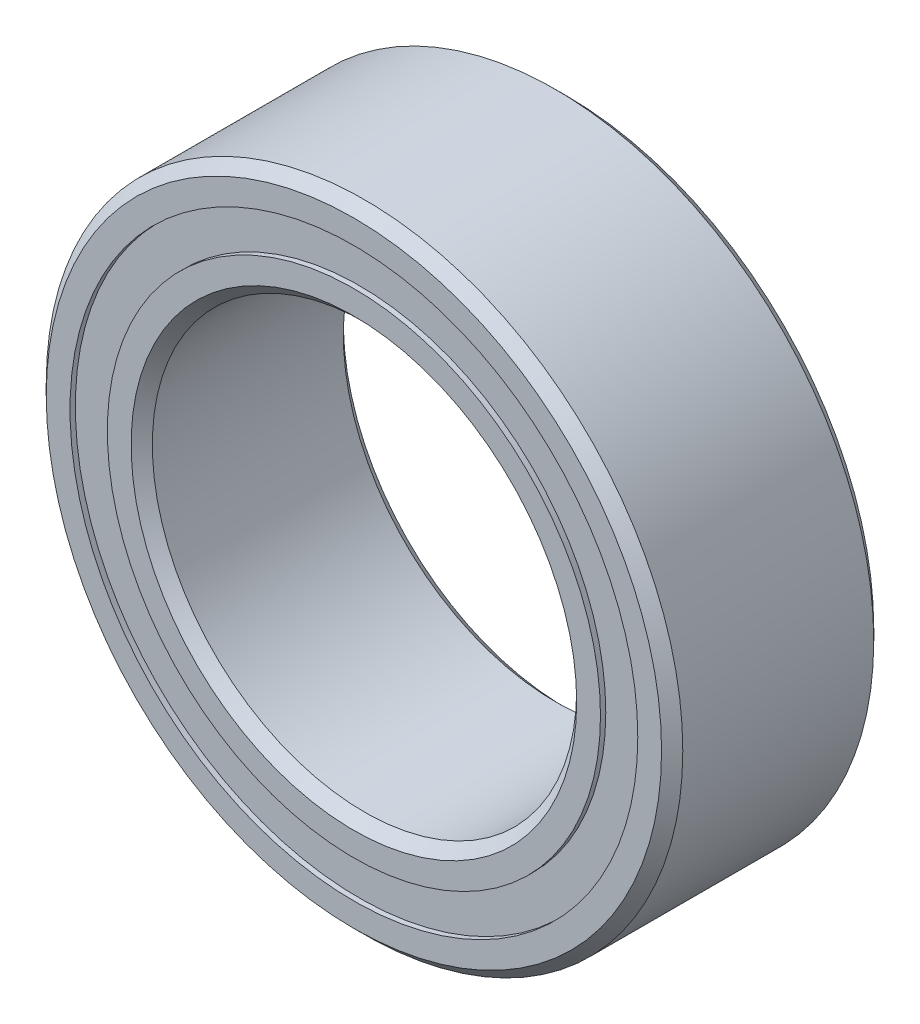
ISO-10303-21;
HEADER;
FILE_DESCRIPTION(('STEP AP214'),'2;1');
FILE_NAME('part.step','',(''),(''),'','','');
FILE_SCHEMA(('AUTOMOTIVE_DESIGN { 1 0 10303 214 1 1 1 1 }'));
ENDSEC;
DATA;
#1=APPLICATION_CONTEXT('core data for automotive mechanical design processes');
#2=APPLICATION_PROTOCOL_DEFINITION('international standard','automotive_design',2000,#1);
#3=PRODUCT_CONTEXT('',#1,'mechanical');
#4=PRODUCT('Part','Part','',(#3));
#5=PRODUCT_RELATED_PRODUCT_CATEGORY('part','',(#4));
#6=PRODUCT_DEFINITION_FORMATION('','',#4);
#7=PRODUCT_DEFINITION_CONTEXT('part definition',#1,'design');
#8=PRODUCT_DEFINITION('design','',#6,#7);
#9=PRODUCT_DEFINITION_SHAPE('','',#8);
#10=(LENGTH_UNIT() NAMED_UNIT(*) SI_UNIT(.MILLI.,.METRE.));
#11=(NAMED_UNIT(*) PLANE_ANGLE_UNIT() SI_UNIT($,.RADIAN.));
#12=(NAMED_UNIT(*) SI_UNIT($,.STERADIAN.) SOLID_ANGLE_UNIT());
#13=UNCERTAINTY_MEASURE_WITH_UNIT(LENGTH_MEASURE(1.E-05),#10,'distance_accuracy_value','');
#14=(GEOMETRIC_REPRESENTATION_CONTEXT(3) GLOBAL_UNCERTAINTY_ASSIGNED_CONTEXT((#13)) GLOBAL_UNIT_ASSIGNED_CONTEXT((#10,
#11,#12)) REPRESENTATION_CONTEXT('',''));
#15=CARTESIAN_POINT('',(0.,0.,0.));
#16=DIRECTION('',(0.,0.,1.));
#17=DIRECTION('',(1.,0.,0.));
#18=AXIS2_PLACEMENT_3D('',#15,#16,#17);
#19=CARTESIAN_POINT('',(-3.96875,0.,0.));
#20=DIRECTION('',(-1.,0.,0.));
#21=DIRECTION('',(0.,0.,-1.));
#22=AXIS2_PLACEMENT_3D('',#19,#20,#21);
#23=SPHERICAL_SURFACE('',#22,0.758760243513404);
#24=CARTESIAN_POINT('',(-4.7275102435134,0.,0.));
#25=VERTEX_POINT('',#24);
#26=VERTEX_LOOP('',#25);
#27=FACE_BOUND('',#26,.T.);
#28=CARTESIAN_POINT('',(-3.2099897564866,0.,0.));
#29=VERTEX_POINT('',#28);
#30=VERTEX_LOOP('',#29);
#31=FACE_BOUND('',#30,.T.);
#32=ADVANCED_FACE('P0_F16',(#27,#31),#23,.T.);
#33=CLOSED_SHELL('',(#32));
#34=MANIFOLD_SOLID_BREP('P0_B1',#33);
#35=CARTESIAN_POINT('',(0.,3.96875,0.));
#36=DIRECTION('',(0.,1.,0.));
#37=DIRECTION('',(0.,0.,-1.));
#38=AXIS2_PLACEMENT_3D('',#35,#36,#37);
#39=SPHERICAL_SURFACE('',#38,0.758760243513404);
#40=CARTESIAN_POINT('',(0.,3.2099897564866,0.));
#41=VERTEX_POINT('',#40);
#42=VERTEX_LOOP('',#41);
#43=FACE_BOUND('',#42,.T.);
#44=CARTESIAN_POINT('',(0.,4.7275102435134,0.));
#45=VERTEX_POINT('',#44);
#46=VERTEX_LOOP('',#45);
#47=FACE_BOUND('',#46,.T.);
#48=ADVANCED_FACE('P1_F16',(#43,#47),#39,.T.);
#49=CLOSED_SHELL('',(#48));
#50=MANIFOLD_SOLID_BREP('P1_B1',#49);
#51=CARTESIAN_POINT('',(3.96875,0.,0.));
#52=DIRECTION('',(1.,0.,0.));
#53=DIRECTION('',(0.,0.,-1.));
#54=AXIS2_PLACEMENT_3D('',#51,#52,#53);
#55=SPHERICAL_SURFACE('',#54,0.758760243513404);
#56=CARTESIAN_POINT('',(3.2099897564866,0.,0.));
#57=VERTEX_POINT('',#56);
#58=VERTEX_LOOP('',#57);
#59=FACE_BOUND('',#58,.T.);
#60=CARTESIAN_POINT('',(4.7275102435134,0.,0.));
#61=VERTEX_POINT('',#60);
#62=VERTEX_LOOP('',#61);
#63=FACE_BOUND('',#62,.T.);
#64=ADVANCED_FACE('P2_F16',(#59,#63),#55,.T.);
#65=CLOSED_SHELL('',(#64));
#66=MANIFOLD_SOLID_BREP('P2_B1',#65);
#67=CARTESIAN_POINT('',(1.98437499999998,-3.4370383212695,0.));
#68=DIRECTION('',(0.499999999999995,-0.866025403784442,0.));
#69=DIRECTION('',(0.,0.,-1.));
#70=AXIS2_PLACEMENT_3D('',#67,#68,#69);
#71=SPHERICAL_SURFACE('',#70,0.758760243513404);
#72=CARTESIAN_POINT('',(2.36375512175668,-4.09414396753378,0.));
#73=VERTEX_POINT('',#72);
#74=VERTEX_LOOP('',#73);
#75=FACE_BOUND('',#74,.T.);
#76=CARTESIAN_POINT('',(1.60499487824328,-2.77993267500523,0.));
#77=VERTEX_POINT('',#76);
#78=VERTEX_LOOP('',#77);
#79=FACE_BOUND('',#78,.T.);
#80=ADVANCED_FACE('P3_F16',(#75,#79),#71,.T.);
#81=CLOSED_SHELL('',(#80));
#82=MANIFOLD_SOLID_BREP('P3_B1',#81);
#83=CARTESIAN_POINT('',(3.43703832126948,-1.98437500000002,0.));
#84=DIRECTION('',(0.866025403784437,-0.500000000000004,0.));
#85=DIRECTION('',(0.,0.,-1.));
#86=AXIS2_PLACEMENT_3D('',#83,#84,#85);
#87=SPHERICAL_SURFACE('',#86,0.758760243513404);
#88=CARTESIAN_POINT('',(4.09414396753376,-2.36375512175672,0.));
#89=VERTEX_POINT('',#88);
#90=VERTEX_LOOP('',#89);
#91=FACE_BOUND('',#90,.T.);
#92=CARTESIAN_POINT('',(2.77993267500521,-1.60499487824331,0.));
#93=VERTEX_POINT('',#92);
#94=VERTEX_LOOP('',#93);
#95=FACE_BOUND('',#94,.T.);
#96=ADVANCED_FACE('P4_F16',(#91,#95),#87,.T.);
#97=CLOSED_SHELL('',(#96));
#98=MANIFOLD_SOLID_BREP('P4_B1',#97);
#99=CARTESIAN_POINT('',(1.984375,3.43703832126949,0.));
#100=DIRECTION('',(0.500000000000001,0.866025403784438,0.));
#101=DIRECTION('',(0.,0.,-1.));
#102=AXIS2_PLACEMENT_3D('',#99,#100,#101);
#103=SPHERICAL_SURFACE('',#102,0.758760243513404);
#104=CARTESIAN_POINT('',(2.36375512175671,4.09414396753376,0.));
#105=VERTEX_POINT('',#104);
#106=VERTEX_LOOP('',#105);
#107=FACE_BOUND('',#106,.T.);
#108=CARTESIAN_POINT('',(1.6049948782433,2.77993267500521,0.));
#109=VERTEX_POINT('',#108);
#110=VERTEX_LOOP('',#109);
#111=FACE_BOUND('',#110,.T.);
#112=ADVANCED_FACE('P5_F16',(#107,#111),#103,.T.);
#113=CLOSED_SHELL('',(#112));
#114=MANIFOLD_SOLID_BREP('P5_B1',#113);
#115=CARTESIAN_POINT('',(-3.43703832126947,1.98437500000004,0.));
#116=DIRECTION('',(-0.866025403784433,0.50000000000001,0.));
#117=DIRECTION('',(0.,0.,-1.));
#118=AXIS2_PLACEMENT_3D('',#115,#116,#117);
#119=SPHERICAL_SURFACE('',#118,0.758760243513404);
#120=CARTESIAN_POINT('',(-2.7799326750052,1.60499487824333,0.));
#121=VERTEX_POINT('',#120);
#122=VERTEX_LOOP('',#121);
#123=FACE_BOUND('',#122,.T.);
#124=CARTESIAN_POINT('',(-4.09414396753374,2.36375512175675,0.));
#125=VERTEX_POINT('',#124);
#126=VERTEX_LOOP('',#125);
#127=FACE_BOUND('',#126,.T.);
#128=ADVANCED_FACE('P6_F16',(#123,#127),#119,.T.);
#129=CLOSED_SHELL('',(#128));
#130=MANIFOLD_SOLID_BREP('P6_B1',#129);
#131=CARTESIAN_POINT('',(0.,4.24787087912088,-1.508125));
#132=DIRECTION('',(0.,0.,1.));
#133=DIRECTION('',(1.,0.,0.));
#134=AXIS2_PLACEMENT_3D('',#131,#132,#133);
#135=PLANE('',#134);
#136=CARTESIAN_POINT('',(0.,0.,-1.508125));
#137=DIRECTION('',(0.,0.,1.));
#138=DIRECTION('',(1.,0.,0.));
#139=AXIS2_PLACEMENT_3D('',#136,#137,#138);
#140=CIRCLE('',#139,3.68962912087912);
#141=CARTESIAN_POINT('',(3.68962912087912,0.,-1.508125));
#142=VERTEX_POINT('',#141);
#143=EDGE_CURVE('P7_E18',#142,#142,#140,.T.);
#144=ORIENTED_EDGE('',*,*,#143,.T.);
#145=EDGE_LOOP('',(#144));
#146=FACE_BOUND('',#145,.T.);
#147=CARTESIAN_POINT('',(0.,0.,-1.508125));
#148=DIRECTION('',(0.,0.,1.));
#149=DIRECTION('',(1.,0.,0.));
#150=AXIS2_PLACEMENT_3D('',#147,#148,#149);
#151=CIRCLE('',#150,4.24787087912088);
#152=CARTESIAN_POINT('',(4.24787087912088,0.,-1.508125));
#153=VERTEX_POINT('',#152);
#154=EDGE_CURVE('P7_E27',#153,#153,#151,.T.);
#155=ORIENTED_EDGE('',*,*,#154,.F.);
#156=EDGE_LOOP('',(#155));
#157=FACE_BOUND('',#156,.T.);
#158=ADVANCED_FACE('P7_F15',(#146,#157),#135,.F.);
#159=CARTESIAN_POINT('',(0.,0.,1.5875));
#160=DIRECTION('',(0.,0.,1.));
#161=DIRECTION('',(1.,0.,0.));
#162=AXIS2_PLACEMENT_3D('',#159,#160,#161);
#163=CYLINDRICAL_SURFACE('',#162,3.68962912087912);
#164=ORIENTED_EDGE('',*,*,#143,.F.);
#165=EDGE_LOOP('',(#164));
#166=FACE_BOUND('',#165,.T.);
#167=CARTESIAN_POINT('',(0.,0.,-0.758760243513405));
#168=DIRECTION('',(0.,0.,1.));
#169=DIRECTION('',(1.,0.,0.));
#170=AXIS2_PLACEMENT_3D('',#167,#168,#169);
#171=CIRCLE('',#170,3.68962912087912);
#172=CARTESIAN_POINT('',(3.68962912087912,0.,-0.758760243513405));
#173=VERTEX_POINT('',#172);
#174=EDGE_CURVE('P7_E22',#173,#173,#171,.T.);
#175=ORIENTED_EDGE('',*,*,#174,.T.);
#176=EDGE_LOOP('',(#175));
#177=FACE_BOUND('',#176,.T.);
#178=ADVANCED_FACE('P7_F37',(#166,#177),#163,.F.);
#179=CARTESIAN_POINT('',(0.,0.,1.5875));
#180=DIRECTION('',(0.,0.,1.));
#181=DIRECTION('',(1.,0.,0.));
#182=AXIS2_PLACEMENT_3D('',#179,#180,#181);
#183=CYLINDRICAL_SURFACE('',#182,4.24787087912088);
#184=CARTESIAN_POINT('',(0.,0.,-0.758760243513404));
#185=DIRECTION('',(0.,0.,1.));
#186=DIRECTION('',(1.,0.,0.));
#187=AXIS2_PLACEMENT_3D('',#184,#185,#186);
#188=CIRCLE('',#187,4.24787087912088);
#189=CARTESIAN_POINT('',(4.24787087912088,0.,-0.758760243513404));
#190=VERTEX_POINT('',#189);
#191=EDGE_CURVE('P7_E10',#190,#190,#188,.F.);
#192=ORIENTED_EDGE('',*,*,#191,.T.);
#193=EDGE_LOOP('',(#192));
#194=FACE_BOUND('',#193,.T.);
#195=ORIENTED_EDGE('',*,*,#154,.T.);
#196=EDGE_LOOP('',(#195));
#197=FACE_BOUND('',#196,.T.);
#198=ADVANCED_FACE('P7_F40',(#194,#197),#183,.T.);
#199=CARTESIAN_POINT('',(0.,4.24787087912088,-0.758760243513404));
#200=DIRECTION('',(0.,0.,-1.));
#201=DIRECTION('',(-1.,0.,0.));
#202=AXIS2_PLACEMENT_3D('',#199,#200,#201);
#203=PLANE('',#202);
#204=ORIENTED_EDGE('',*,*,#191,.F.);
#205=EDGE_LOOP('',(#204));
#206=FACE_BOUND('',#205,.T.);
#207=ORIENTED_EDGE('',*,*,#174,.F.);
#208=EDGE_LOOP('',(#207));
#209=FACE_BOUND('',#208,.T.);
#210=ADVANCED_FACE('P7_F43',(#206,#209),#203,.F.);
#211=CLOSED_SHELL('',(#158,#178,#198,#210));
#212=MANIFOLD_SOLID_BREP('P7_B1',#211);
#213=CARTESIAN_POINT('',(0.,0.,0.));
#214=DIRECTION('',(0.,0.,1.));
#215=DIRECTION('',(1.,0.,0.));
#216=AXIS2_PLACEMENT_3D('',#213,#214,#215);
#217=TOROIDAL_SURFACE('',#216,3.96875,0.758760243513403);
#218=CARTESIAN_POINT('',(0.,0.,0.705555555555556));
#219=DIRECTION('',(0.,0.,1.));
#220=DIRECTION('',(1.,0.,0.));
#221=AXIS2_PLACEMENT_3D('',#218,#219,#220);
#222=CIRCLE('',#221,3.68962912087912);
#223=CARTESIAN_POINT('',(3.68962912087912,0.,0.705555555555556));
#224=VERTEX_POINT('',#223);
#225=EDGE_CURVE('P8_E33',#224,#224,#222,.T.);
#226=ORIENTED_EDGE('',*,*,#225,.F.);
#227=EDGE_LOOP('',(#226));
#228=FACE_BOUND('',#227,.T.);
#229=CARTESIAN_POINT('',(0.,0.,-0.705555555555556));
#230=DIRECTION('',(0.,0.,1.));
#231=DIRECTION('',(1.,0.,0.));
#232=AXIS2_PLACEMENT_3D('',#229,#230,#231);
#233=CIRCLE('',#232,3.68962912087912);
#234=CARTESIAN_POINT('',(3.68962912087912,0.,-0.705555555555556));
#235=VERTEX_POINT('',#234);
#236=EDGE_CURVE('P8_E31',#235,#235,#233,.F.);
#237=ORIENTED_EDGE('',*,*,#236,.F.);
#238=EDGE_LOOP('',(#237));
#239=FACE_BOUND('',#238,.T.);
#240=ADVANCED_FACE('P8_F15',(#228,#239),#217,.F.);
#241=CARTESIAN_POINT('',(0.,0.,1.5875));
#242=DIRECTION('',(0.,0.,1.));
#243=DIRECTION('',(1.,0.,0.));
#244=AXIS2_PLACEMENT_3D('',#241,#242,#243);
#245=CYLINDRICAL_SURFACE('',#244,3.68962912087912);
#246=CARTESIAN_POINT('',(0.,0.,1.5875));
#247=DIRECTION('',(0.,0.,1.));
#248=DIRECTION('',(1.,0.,0.));
#249=AXIS2_PLACEMENT_3D('',#246,#247,#248);
#250=CIRCLE('',#249,3.68962912087912);
#251=CARTESIAN_POINT('',(3.68962912087912,0.,1.5875));
#252=VERTEX_POINT('',#251);
#253=EDGE_CURVE('P8_E19',#252,#252,#250,.F.);
#254=ORIENTED_EDGE('',*,*,#253,.T.);
#255=EDGE_LOOP('',(#254));
#256=FACE_BOUND('',#255,.T.);
#257=ORIENTED_EDGE('',*,*,#225,.T.);
#258=EDGE_LOOP('',(#257));
#259=FACE_BOUND('',#258,.T.);
#260=ADVANCED_FACE('P8_F49',(#256,#259),#245,.T.);
#261=CARTESIAN_POINT('',(0.,0.,1.5875));
#262=DIRECTION('',(0.,0.,1.));
#263=DIRECTION('',(1.,0.,0.));
#264=AXIS2_PLACEMENT_3D('',#261,#262,#263);
#265=CYLINDRICAL_SURFACE('',#264,3.68962912087912);
#266=ORIENTED_EDGE('',*,*,#236,.T.);
#267=EDGE_LOOP('',(#266));
#268=FACE_BOUND('',#267,.T.);
#269=CARTESIAN_POINT('',(0.,0.,-1.5875));
#270=DIRECTION('',(0.,0.,1.));
#271=DIRECTION('',(1.,0.,0.));
#272=AXIS2_PLACEMENT_3D('',#269,#270,#271);
#273=CIRCLE('',#272,3.68962912087912);
#274=CARTESIAN_POINT('',(3.68962912087912,0.,-1.5875));
#275=VERTEX_POINT('',#274);
#276=EDGE_CURVE('P8_E42',#275,#275,#273,.T.);
#277=ORIENTED_EDGE('',*,*,#276,.T.);
#278=EDGE_LOOP('',(#277));
#279=FACE_BOUND('',#278,.T.);
#280=ADVANCED_FACE('P8_F56',(#268,#279),#265,.T.);
#281=CARTESIAN_POINT('',(0.,3.68962912087912,1.5875));
#282=DIRECTION('',(0.,0.,-1.));
#283=DIRECTION('',(-1.,0.,0.));
#284=AXIS2_PLACEMENT_3D('',#281,#282,#283);
#285=PLANE('',#284);
#286=ORIENTED_EDGE('',*,*,#253,.F.);
#287=EDGE_LOOP('',(#286));
#288=FACE_BOUND('',#287,.T.);
#289=CARTESIAN_POINT('',(0.,0.,1.58749999997099));
#290=DIRECTION('',(0.,0.,1.));
#291=DIRECTION('',(1.,0.,0.));
#292=AXIS2_PLACEMENT_3D('',#289,#290,#291);
#293=CIRCLE('',#292,3.33374999996749);
#294=CARTESIAN_POINT('',(3.33374999996749,0.,1.58749999997099));
#295=VERTEX_POINT('',#294);
#296=EDGE_CURVE('P8_E40',#295,#295,#293,.F.);
#297=ORIENTED_EDGE('',*,*,#296,.T.);
#298=EDGE_LOOP('',(#297));
#299=FACE_BOUND('',#298,.T.);
#300=ADVANCED_FACE('P8_F52',(#288,#299),#285,.F.);
#301=CARTESIAN_POINT('',(0.,3.33375,-1.5875));
#302=DIRECTION('',(0.,0.,1.));
#303=DIRECTION('',(1.,0.,0.));
#304=AXIS2_PLACEMENT_3D('',#301,#302,#303);
#305=PLANE('',#304);
#306=CARTESIAN_POINT('',(0.,0.,-1.58749999997099));
#307=DIRECTION('',(0.,0.,-1.));
#308=DIRECTION('',(0.,1.,0.));
#309=AXIS2_PLACEMENT_3D('',#306,#307,#308);
#310=CIRCLE('',#309,3.33375000002434);
#311=CARTESIAN_POINT('',(0.,3.33375000002434,-1.58749999997099));
#312=VERTEX_POINT('',#311);
#313=EDGE_CURVE('P8_E28',#312,#312,#310,.F.);
#314=ORIENTED_EDGE('',*,*,#313,.T.);
#315=EDGE_LOOP('',(#314));
#316=FACE_BOUND('',#315,.T.);
#317=ORIENTED_EDGE('',*,*,#276,.F.);
#318=EDGE_LOOP('',(#317));
#319=FACE_BOUND('',#318,.T.);
#320=ADVANCED_FACE('P8_F55',(#316,#319),#305,.F.);
#321=CARTESIAN_POINT('',(0.,0.,1.58749999991414));
#322=DIRECTION('',(0.,0.,1.));
#323=DIRECTION('',(1.,0.,0.));
#324=AXIS2_PLACEMENT_3D('',#321,#322,#323);
#325=CONICAL_SURFACE('',#324,3.33374999991065,0.785398163397448);
#326=ORIENTED_EDGE('',*,*,#296,.F.);
#327=EDGE_LOOP('',(#326));
#328=FACE_BOUND('',#327,.T.);
#329=CARTESIAN_POINT('',(0.,0.,1.42875));
#330=DIRECTION('',(0.,0.,1.));
#331=DIRECTION('',(1.,0.,0.));
#332=AXIS2_PLACEMENT_3D('',#329,#330,#331);
#333=CIRCLE('',#332,3.175);
#334=CARTESIAN_POINT('',(3.175,0.,1.42875));
#335=VERTEX_POINT('',#334);
#336=EDGE_CURVE('P8_E23',#335,#335,#333,.F.);
#337=ORIENTED_EDGE('',*,*,#336,.T.);
#338=EDGE_LOOP('',(#337));
#339=FACE_BOUND('',#338,.T.);
#340=ADVANCED_FACE('P8_F60',(#328,#339),#325,.F.);
#341=CARTESIAN_POINT('',(0.,0.,-1.58749999997099));
#342=DIRECTION('',(0.,0.,-1.));
#343=DIRECTION('',(0.,1.,0.));
#344=AXIS2_PLACEMENT_3D('',#341,#342,#343);
#345=CONICAL_SURFACE('',#344,3.33375000002434,0.785398163397448);
#346=CARTESIAN_POINT('',(0.,0.,-1.42875));
#347=DIRECTION('',(0.,0.,1.));
#348=DIRECTION('',(1.,0.,0.));
#349=AXIS2_PLACEMENT_3D('',#346,#347,#348);
#350=CIRCLE('',#349,3.175);
#351=CARTESIAN_POINT('',(3.175,0.,-1.42875));
#352=VERTEX_POINT('',#351);
#353=EDGE_CURVE('P8_E10',#352,#352,#350,.T.);
#354=ORIENTED_EDGE('',*,*,#353,.T.);
#355=EDGE_LOOP('',(#354));
#356=FACE_BOUND('',#355,.T.);
#357=ORIENTED_EDGE('',*,*,#313,.F.);
#358=EDGE_LOOP('',(#357));
#359=FACE_BOUND('',#358,.T.);
#360=ADVANCED_FACE('P8_F63',(#356,#359),#345,.F.);
#361=CARTESIAN_POINT('',(0.,0.,1.5875));
#362=DIRECTION('',(0.,0.,1.));
#363=DIRECTION('',(1.,0.,0.));
#364=AXIS2_PLACEMENT_3D('',#361,#362,#363);
#365=CYLINDRICAL_SURFACE('',#364,3.175);
#366=ORIENTED_EDGE('',*,*,#336,.F.);
#367=EDGE_LOOP('',(#366));
#368=FACE_BOUND('',#367,.T.);
#369=ORIENTED_EDGE('',*,*,#353,.F.);
#370=EDGE_LOOP('',(#369));
#371=FACE_BOUND('',#370,.T.);
#372=ADVANCED_FACE('P8_F67',(#368,#371),#365,.F.);
#373=CLOSED_SHELL('',(#240,#260,#280,#300,#320,#340,#360,#372));
#374=MANIFOLD_SOLID_BREP('P8_B1',#373);
#375=CARTESIAN_POINT('',(-1.98437499999996,3.43703832126952,0.));
#376=DIRECTION('',(-0.499999999999989,0.866025403784445,0.));
#377=DIRECTION('',(0.,0.,-1.));
#378=AXIS2_PLACEMENT_3D('',#375,#376,#377);
#379=SPHERICAL_SURFACE('',#378,0.758760243513404);
#380=CARTESIAN_POINT('',(-2.36375512175665,4.0941439675338,0.));
#381=VERTEX_POINT('',#380);
#382=VERTEX_LOOP('',#381);
#383=FACE_BOUND('',#382,.T.);
#384=CARTESIAN_POINT('',(-1.60499487824326,2.77993267500524,0.));
#385=VERTEX_POINT('',#384);
#386=VERTEX_LOOP('',#385);
#387=FACE_BOUND('',#386,.T.);
#388=ADVANCED_FACE('P9_F16',(#383,#387),#379,.T.);
#389=CLOSED_SHELL('',(#388));
#390=MANIFOLD_SOLID_BREP('P9_B1',#389);
#391=CARTESIAN_POINT('',(-3.43703832126951,-1.98437499999997,0.));
#392=DIRECTION('',(-0.866025403784443,-0.499999999999992,0.));
#393=DIRECTION('',(0.,0.,-1.));
#394=AXIS2_PLACEMENT_3D('',#391,#392,#393);
#395=SPHERICAL_SURFACE('',#394,0.758760243513404);
#396=CARTESIAN_POINT('',(-4.09414396753379,-2.36375512175666,0.));
#397=VERTEX_POINT('',#396);
#398=VERTEX_LOOP('',#397);
#399=FACE_BOUND('',#398,.T.);
#400=CARTESIAN_POINT('',(-2.77993267500523,-1.60499487824327,0.));
#401=VERTEX_POINT('',#400);
#402=VERTEX_LOOP('',#401);
#403=FACE_BOUND('',#402,.T.);
#404=ADVANCED_FACE('P10_F16',(#399,#403),#395,.T.);
#405=CLOSED_SHELL('',(#404));
#406=MANIFOLD_SOLID_BREP('P10_B1',#405);
#407=CARTESIAN_POINT('',(-1.98437500000003,-3.43703832126947,0.));
#408=DIRECTION('',(-0.500000000000007,-0.866025403784435,0.));
#409=DIRECTION('',(0.,0.,-1.));
#410=AXIS2_PLACEMENT_3D('',#407,#408,#409);
#411=SPHERICAL_SURFACE('',#410,0.758760243513404);
#412=CARTESIAN_POINT('',(-1.60499487824332,-2.7799326750052,0.));
#413=VERTEX_POINT('',#412);
#414=VERTEX_LOOP('',#413);
#415=FACE_BOUND('',#414,.T.);
#416=CARTESIAN_POINT('',(-2.36375512175674,-4.09414396753375,0.));
#417=VERTEX_POINT('',#416);
#418=VERTEX_LOOP('',#417);
#419=FACE_BOUND('',#418,.T.);
#420=ADVANCED_FACE('P11_F16',(#415,#419),#411,.T.);
#421=CLOSED_SHELL('',(#420));
#422=MANIFOLD_SOLID_BREP('P11_B1',#421);
#423=CARTESIAN_POINT('',(0.,-3.96875,0.));
#424=DIRECTION('',(0.,-1.,0.));
#425=DIRECTION('',(0.,0.,-1.));
#426=AXIS2_PLACEMENT_3D('',#423,#424,#425);
#427=SPHERICAL_SURFACE('',#426,0.758760243513404);
#428=CARTESIAN_POINT('',(0.,-3.2099897564866,0.));
#429=VERTEX_POINT('',#428);
#430=VERTEX_LOOP('',#429);
#431=FACE_BOUND('',#430,.T.);
#432=CARTESIAN_POINT('',(0.,-4.7275102435134,0.));
#433=VERTEX_POINT('',#432);
#434=VERTEX_LOOP('',#433);
#435=FACE_BOUND('',#434,.T.);
#436=ADVANCED_FACE('P12_F16',(#431,#435),#427,.T.);
#437=CLOSED_SHELL('',(#436));
#438=MANIFOLD_SOLID_BREP('P12_B1',#437);
#439=CARTESIAN_POINT('',(0.,4.24787087912088,0.758760243513404));
#440=DIRECTION('',(0.,0.,1.));
#441=DIRECTION('',(1.,0.,0.));
#442=AXIS2_PLACEMENT_3D('',#439,#440,#441);
#443=PLANE('',#442);
#444=CARTESIAN_POINT('',(0.,0.,0.758760243513404));
#445=DIRECTION('',(0.,0.,1.));
#446=DIRECTION('',(1.,0.,0.));
#447=AXIS2_PLACEMENT_3D('',#444,#445,#446);
#448=CIRCLE('',#447,3.68962912087912);
#449=CARTESIAN_POINT('',(3.68962912087912,0.,0.758760243513404));
#450=VERTEX_POINT('',#449);
#451=EDGE_CURVE('P13_E18',#450,#450,#448,.T.);
#452=ORIENTED_EDGE('',*,*,#451,.T.);
#453=EDGE_LOOP('',(#452));
#454=FACE_BOUND('',#453,.T.);
#455=CARTESIAN_POINT('',(0.,0.,0.758760243513404));
#456=DIRECTION('',(0.,0.,1.));
#457=DIRECTION('',(1.,0.,0.));
#458=AXIS2_PLACEMENT_3D('',#455,#456,#457);
#459=CIRCLE('',#458,4.24787087912088);
#460=CARTESIAN_POINT('',(4.24787087912088,0.,0.758760243513404));
#461=VERTEX_POINT('',#460);
#462=EDGE_CURVE('P13_E27',#461,#461,#459,.T.);
#463=ORIENTED_EDGE('',*,*,#462,.F.);
#464=EDGE_LOOP('',(#463));
#465=FACE_BOUND('',#464,.T.);
#466=ADVANCED_FACE('P13_F15',(#454,#465),#443,.F.);
#467=CARTESIAN_POINT('',(0.,0.,1.5875));
#468=DIRECTION('',(0.,0.,1.));
#469=DIRECTION('',(1.,0.,0.));
#470=AXIS2_PLACEMENT_3D('',#467,#468,#469);
#471=CYLINDRICAL_SURFACE('',#470,3.68962912087912);
#472=ORIENTED_EDGE('',*,*,#451,.F.);
#473=EDGE_LOOP('',(#472));
#474=FACE_BOUND('',#473,.T.);
#475=CARTESIAN_POINT('',(0.,0.,1.508125));
#476=DIRECTION('',(0.,0.,1.));
#477=DIRECTION('',(1.,0.,0.));
#478=AXIS2_PLACEMENT_3D('',#475,#476,#477);
#479=CIRCLE('',#478,3.68962912087912);
#480=CARTESIAN_POINT('',(3.68962912087912,0.,1.508125));
#481=VERTEX_POINT('',#480);
#482=EDGE_CURVE('P13_E22',#481,#481,#479,.T.);
#483=ORIENTED_EDGE('',*,*,#482,.T.);
#484=EDGE_LOOP('',(#483));
#485=FACE_BOUND('',#484,.T.);
#486=ADVANCED_FACE('P13_F37',(#474,#485),#471,.F.);
#487=CARTESIAN_POINT('',(0.,0.,1.5875));
#488=DIRECTION('',(0.,0.,1.));
#489=DIRECTION('',(1.,0.,0.));
#490=AXIS2_PLACEMENT_3D('',#487,#488,#489);
#491=CYLINDRICAL_SURFACE('',#490,4.24787087912088);
#492=CARTESIAN_POINT('',(0.,0.,1.508125));
#493=DIRECTION('',(0.,0.,1.));
#494=DIRECTION('',(1.,0.,0.));
#495=AXIS2_PLACEMENT_3D('',#492,#493,#494);
#496=CIRCLE('',#495,4.24787087912088);
#497=CARTESIAN_POINT('',(4.24787087912088,0.,1.508125));
#498=VERTEX_POINT('',#497);
#499=EDGE_CURVE('P13_E10',#498,#498,#496,.F.);
#500=ORIENTED_EDGE('',*,*,#499,.T.);
#501=EDGE_LOOP('',(#500));
#502=FACE_BOUND('',#501,.T.);
#503=ORIENTED_EDGE('',*,*,#462,.T.);
#504=EDGE_LOOP('',(#503));
#505=FACE_BOUND('',#504,.T.);
#506=ADVANCED_FACE('P13_F40',(#502,#505),#491,.T.);
#507=CARTESIAN_POINT('',(0.,4.24787087912088,1.508125));
#508=DIRECTION('',(0.,0.,-1.));
#509=DIRECTION('',(-1.,0.,0.));
#510=AXIS2_PLACEMENT_3D('',#507,#508,#509);
#511=PLANE('',#510);
#512=ORIENTED_EDGE('',*,*,#499,.F.);
#513=EDGE_LOOP('',(#512));
#514=FACE_BOUND('',#513,.T.);
#515=ORIENTED_EDGE('',*,*,#482,.F.);
#516=EDGE_LOOP('',(#515));
#517=FACE_BOUND('',#516,.T.);
#518=ADVANCED_FACE('P13_F43',(#514,#517),#511,.F.);
#519=CLOSED_SHELL('',(#466,#486,#506,#518));
#520=MANIFOLD_SOLID_BREP('P13_B1',#519);
#521=CARTESIAN_POINT('',(0.,0.,0.));
#522=DIRECTION('',(0.,0.,1.));
#523=DIRECTION('',(1.,0.,0.));
#524=AXIS2_PLACEMENT_3D('',#521,#522,#523);
#525=TOROIDAL_SURFACE('',#524,3.96875,0.758760243513404);
#526=CARTESIAN_POINT('',(0.,0.,-0.705555555555556));
#527=DIRECTION('',(0.,0.,1.));
#528=DIRECTION('',(1.,0.,0.));
#529=AXIS2_PLACEMENT_3D('',#526,#527,#528);
#530=CIRCLE('',#529,4.24787087912088);
#531=CARTESIAN_POINT('',(4.24787087912088,0.,-0.705555555555556));
#532=VERTEX_POINT('',#531);
#533=EDGE_CURVE('P14_E33',#532,#532,#530,.F.);
#534=ORIENTED_EDGE('',*,*,#533,.T.);
#535=EDGE_LOOP('',(#534));
#536=FACE_BOUND('',#535,.T.);
#537=CARTESIAN_POINT('',(0.,0.,0.705555555555555));
#538=DIRECTION('',(0.,0.,1.));
#539=DIRECTION('',(1.,0.,0.));
#540=AXIS2_PLACEMENT_3D('',#537,#538,#539);
#541=CIRCLE('',#540,4.24787087912088);
#542=CARTESIAN_POINT('',(4.24787087912088,0.,0.705555555555555));
#543=VERTEX_POINT('',#542);
#544=EDGE_CURVE('P14_E31',#543,#543,#541,.T.);
#545=ORIENTED_EDGE('',*,*,#544,.T.);
#546=EDGE_LOOP('',(#545));
#547=FACE_BOUND('',#546,.T.);
#548=ADVANCED_FACE('P14_F15',(#536,#547),#525,.F.);
#549=CARTESIAN_POINT('',(0.,0.,1.5875));
#550=DIRECTION('',(0.,0.,1.));
#551=DIRECTION('',(1.,0.,0.));
#552=AXIS2_PLACEMENT_3D('',#549,#550,#551);
#553=CYLINDRICAL_SURFACE('',#552,4.24787087912088);
#554=CARTESIAN_POINT('',(0.,0.,-1.5875));
#555=DIRECTION('',(0.,0.,1.));
#556=DIRECTION('',(1.,0.,0.));
#557=AXIS2_PLACEMENT_3D('',#554,#555,#556);
#558=CIRCLE('',#557,4.24787087912088);
#559=CARTESIAN_POINT('',(4.24787087912088,0.,-1.5875));
#560=VERTEX_POINT('',#559);
#561=EDGE_CURVE('P14_E19',#560,#560,#558,.F.);
#562=ORIENTED_EDGE('',*,*,#561,.T.);
#563=EDGE_LOOP('',(#562));
#564=FACE_BOUND('',#563,.T.);
#565=ORIENTED_EDGE('',*,*,#533,.F.);
#566=EDGE_LOOP('',(#565));
#567=FACE_BOUND('',#566,.T.);
#568=ADVANCED_FACE('P14_F49',(#564,#567),#553,.F.);
#569=CARTESIAN_POINT('',(0.,0.,1.5875));
#570=DIRECTION('',(0.,0.,1.));
#571=DIRECTION('',(1.,0.,0.));
#572=AXIS2_PLACEMENT_3D('',#569,#570,#571);
#573=CYLINDRICAL_SURFACE('',#572,4.24787087912088);
#574=ORIENTED_EDGE('',*,*,#544,.F.);
#575=EDGE_LOOP('',(#574));
#576=FACE_BOUND('',#575,.T.);
#577=CARTESIAN_POINT('',(0.,0.,1.5875));
#578=DIRECTION('',(0.,0.,1.));
#579=DIRECTION('',(1.,0.,0.));
#580=AXIS2_PLACEMENT_3D('',#577,#578,#579);
#581=CIRCLE('',#580,4.24787087912088);
#582=CARTESIAN_POINT('',(4.24787087912088,0.,1.5875));
#583=VERTEX_POINT('',#582);
#584=EDGE_CURVE('P14_E42',#583,#583,#581,.T.);
#585=ORIENTED_EDGE('',*,*,#584,.T.);
#586=EDGE_LOOP('',(#585));
#587=FACE_BOUND('',#586,.T.);
#588=ADVANCED_FACE('P14_F56',(#576,#587),#573,.F.);
#589=CARTESIAN_POINT('',(0.,4.60375,-1.5875));
#590=DIRECTION('',(0.,0.,1.));
#591=DIRECTION('',(1.,0.,0.));
#592=AXIS2_PLACEMENT_3D('',#589,#590,#591);
#593=PLANE('',#592);
#594=ORIENTED_EDGE('',*,*,#561,.F.);
#595=EDGE_LOOP('',(#594));
#596=FACE_BOUND('',#595,.T.);
#597=CARTESIAN_POINT('',(0.,0.,-1.58750000002783));
#598=DIRECTION('',(0.,0.,1.));
#599=DIRECTION('',(1.,0.,0.));
#600=AXIS2_PLACEMENT_3D('',#597,#598,#599);
#601=CIRCLE('',#600,4.60375000000113);
#602=CARTESIAN_POINT('',(4.60375000000113,0.,-1.58750000002783));
#603=VERTEX_POINT('',#602);
#604=EDGE_CURVE('P14_E40',#603,#603,#601,.T.);
#605=ORIENTED_EDGE('',*,*,#604,.F.);
#606=EDGE_LOOP('',(#605));
#607=FACE_BOUND('',#606,.T.);
#608=ADVANCED_FACE('P14_F52',(#596,#607),#593,.F.);
#609=CARTESIAN_POINT('',(0.,4.60375,1.5875));
#610=DIRECTION('',(0.,0.,-1.));
#611=DIRECTION('',(-1.,0.,0.));
#612=AXIS2_PLACEMENT_3D('',#609,#610,#611);
#613=PLANE('',#612);
#614=CARTESIAN_POINT('',(0.,0.,1.58750000008467));
#615=DIRECTION('',(0.,0.,-1.));
#616=DIRECTION('',(-1.,0.,0.));
#617=AXIS2_PLACEMENT_3D('',#614,#615,#616);
#618=CIRCLE('',#617,4.60375000000113);
#619=CARTESIAN_POINT('',(-4.60375000000113,0.,1.58750000008467));
#620=VERTEX_POINT('',#619);
#621=EDGE_CURVE('P14_E28',#620,#620,#618,.T.);
#622=ORIENTED_EDGE('',*,*,#621,.F.);
#623=EDGE_LOOP('',(#622));
#624=FACE_BOUND('',#623,.T.);
#625=ORIENTED_EDGE('',*,*,#584,.F.);
#626=EDGE_LOOP('',(#625));
#627=FACE_BOUND('',#626,.T.);
#628=ADVANCED_FACE('P14_F55',(#624,#627),#613,.F.);
#629=CARTESIAN_POINT('',(0.,0.,-1.42874999994547));
#630=DIRECTION('',(0.,0.,1.));
#631=DIRECTION('',(1.,0.,0.));
#632=AXIS2_PLACEMENT_3D('',#629,#630,#631);
#633=CONICAL_SURFACE('',#632,4.76250000002665,0.785398163218414);
#634=CARTESIAN_POINT('',(0.,0.,-1.42875));
#635=DIRECTION('',(0.,0.,1.));
#636=DIRECTION('',(1.,0.,0.));
#637=AXIS2_PLACEMENT_3D('',#634,#635,#636);
#638=CIRCLE('',#637,4.7625);
#639=CARTESIAN_POINT('',(4.7625,0.,-1.42875));
#640=VERTEX_POINT('',#639);
#641=EDGE_CURVE('P14_E23',#640,#640,#638,.T.);
#642=ORIENTED_EDGE('',*,*,#641,.F.);
#643=EDGE_LOOP('',(#642));
#644=FACE_BOUND('',#643,.T.);
#645=ORIENTED_EDGE('',*,*,#604,.T.);
#646=EDGE_LOOP('',(#645));
#647=FACE_BOUND('',#646,.T.);
#648=ADVANCED_FACE('P14_F60',(#644,#647),#633,.T.);
#649=CARTESIAN_POINT('',(0.,0.,1.42875000005915));
#650=DIRECTION('',(0.,0.,-1.));
#651=DIRECTION('',(-1.,0.,0.));
#652=AXIS2_PLACEMENT_3D('',#649,#650,#651);
#653=CONICAL_SURFACE('',#652,4.7624999999698,0.785398163218414);
#654=CARTESIAN_POINT('',(0.,0.,1.42875));
#655=DIRECTION('',(0.,0.,1.));
#656=DIRECTION('',(1.,0.,0.));
#657=AXIS2_PLACEMENT_3D('',#654,#655,#656);
#658=CIRCLE('',#657,4.7625);
#659=CARTESIAN_POINT('',(4.7625,0.,1.42875));
#660=VERTEX_POINT('',#659);
#661=EDGE_CURVE('P14_E10',#660,#660,#658,.F.);
#662=ORIENTED_EDGE('',*,*,#661,.F.);
#663=EDGE_LOOP('',(#662));
#664=FACE_BOUND('',#663,.T.);
#665=ORIENTED_EDGE('',*,*,#621,.T.);
#666=EDGE_LOOP('',(#665));
#667=FACE_BOUND('',#666,.T.);
#668=ADVANCED_FACE('P14_F62',(#664,#667),#653,.T.);
#669=CARTESIAN_POINT('',(0.,0.,1.5875));
#670=DIRECTION('',(0.,0.,1.));
#671=DIRECTION('',(1.,0.,0.));
#672=AXIS2_PLACEMENT_3D('',#669,#670,#671);
#673=CYLINDRICAL_SURFACE('',#672,4.7625);
#674=ORIENTED_EDGE('',*,*,#661,.T.);
#675=EDGE_LOOP('',(#674));
#676=FACE_BOUND('',#675,.T.);
#677=ORIENTED_EDGE('',*,*,#641,.T.);
#678=EDGE_LOOP('',(#677));
#679=FACE_BOUND('',#678,.T.);
#680=ADVANCED_FACE('P14_F70',(#676,#679),#673,.T.);
#681=CLOSED_SHELL('',(#548,#568,#588,#608,#628,#648,#668,#680));
#682=MANIFOLD_SOLID_BREP('P14_B1',#681);
#683=CARTESIAN_POINT('',(3.4370383212695,1.98437499999999,0.));
#684=DIRECTION('',(0.86602540378444,0.499999999999998,0.));
#685=DIRECTION('',(0.,0.,-1.));
#686=AXIS2_PLACEMENT_3D('',#683,#684,#685);
#687=SPHERICAL_SURFACE('',#686,0.758760243513404);
#688=CARTESIAN_POINT('',(4.09414396753377,2.36375512175669,0.));
#689=VERTEX_POINT('',#688);
#690=VERTEX_LOOP('',#689);
#691=FACE_BOUND('',#690,.T.);
#692=CARTESIAN_POINT('',(2.77993267500522,1.60499487824329,0.));
#693=VERTEX_POINT('',#692);
#694=VERTEX_LOOP('',#693);
#695=FACE_BOUND('',#694,.T.);
#696=ADVANCED_FACE('P15_F16',(#691,#695),#687,.T.);
#697=CLOSED_SHELL('',(#696));
#698=MANIFOLD_SOLID_BREP('P15_B1',#697);
#699=ADVANCED_BREP_SHAPE_REPRESENTATION('',(#18,#34,#50,#66,#82,#98,#114,#130,#212,#374,#390,
#406,#422,#438,#520,#682,#698),#14);
#700=SHAPE_DEFINITION_REPRESENTATION(#9,#699);
ENDSEC;
END-ISO-10303-21;
